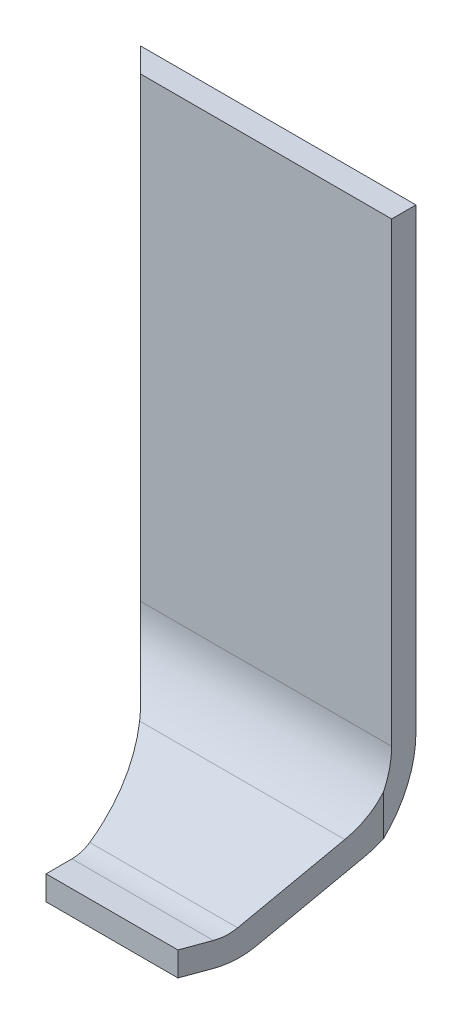
ISO-10303-21;
HEADER;
FILE_DESCRIPTION(('STEP AP214'),'2;1');
FILE_NAME('part.step','',(''),(''),'','','');
FILE_SCHEMA(('AUTOMOTIVE_DESIGN { 1 0 10303 214 1 1 1 1 }'));
ENDSEC;
DATA;
#1=APPLICATION_CONTEXT('core data for automotive mechanical design processes');
#2=APPLICATION_PROTOCOL_DEFINITION('international standard','automotive_design',2000,#1);
#3=PRODUCT_CONTEXT('',#1,'mechanical');
#4=PRODUCT('Part','Part','',(#3));
#5=PRODUCT_RELATED_PRODUCT_CATEGORY('part','',(#4));
#6=PRODUCT_DEFINITION_FORMATION('','',#4);
#7=PRODUCT_DEFINITION_CONTEXT('part definition',#1,'design');
#8=PRODUCT_DEFINITION('design','',#6,#7);
#9=PRODUCT_DEFINITION_SHAPE('','',#8);
#10=(LENGTH_UNIT() NAMED_UNIT(*) SI_UNIT(.MILLI.,.METRE.));
#11=(NAMED_UNIT(*) PLANE_ANGLE_UNIT() SI_UNIT($,.RADIAN.));
#12=(NAMED_UNIT(*) SI_UNIT($,.STERADIAN.) SOLID_ANGLE_UNIT());
#13=UNCERTAINTY_MEASURE_WITH_UNIT(LENGTH_MEASURE(1.E-05),#10,'distance_accuracy_value','');
#14=(GEOMETRIC_REPRESENTATION_CONTEXT(3) GLOBAL_UNCERTAINTY_ASSIGNED_CONTEXT((#13)) GLOBAL_UNIT_ASSIGNED_CONTEXT((#10,
#11,#12)) REPRESENTATION_CONTEXT('',''));
#15=CARTESIAN_POINT('',(0.,0.,0.));
#16=DIRECTION('',(0.,0.,1.));
#17=DIRECTION('',(1.,0.,0.));
#18=AXIS2_PLACEMENT_3D('',#15,#16,#17);
#19=CARTESIAN_POINT('',(100.,0.,0.));
#20=DIRECTION('',(0.,0.,-1.));
#21=DIRECTION('',(-1.,0.,0.));
#22=AXIS2_PLACEMENT_3D('',#19,#20,#21);
#23=PLANE('',#22);
#24=DIRECTION('',(-1.,0.,0.));
#25=VECTOR('',#24,1.);
#26=CARTESIAN_POINT('',(100.,15.,0.));
#27=LINE('',#26,#25);
#28=CARTESIAN_POINT('',(56.4558441227153,15.,0.));
#29=VERTEX_POINT('',#28);
#30=CARTESIAN_POINT('',(-25.,15.,0.));
#31=VERTEX_POINT('',#30);
#32=EDGE_CURVE('E160',#29,#31,#27,.T.);
#33=ORIENTED_EDGE('',*,*,#32,.T.);
#34=DIRECTION('',(0.,-1.,0.));
#35=VECTOR('',#34,1.);
#36=CARTESIAN_POINT('',(-25.,374.,0.));
#37=LINE('',#36,#35);
#38=CARTESIAN_POINT('',(-25.,0.,0.));
#39=VERTEX_POINT('',#38);
#40=EDGE_CURVE('E61',#31,#39,#37,.T.);
#41=ORIENTED_EDGE('',*,*,#40,.T.);
#42=DIRECTION('',(-1.,0.,0.));
#43=VECTOR('',#42,1.);
#44=CARTESIAN_POINT('',(100.,0.,0.));
#45=LINE('',#44,#43);
#46=CARTESIAN_POINT('',(56.4558441227153,0.,0.));
#47=VERTEX_POINT('',#46);
#48=EDGE_CURVE('E158',#47,#39,#45,.T.);
#49=ORIENTED_EDGE('',*,*,#48,.F.);
#50=DIRECTION('',(0.,-1.,0.));
#51=VECTOR('',#50,1.);
#52=CARTESIAN_POINT('',(56.4558441227153,374.,0.));
#53=LINE('',#52,#51);
#54=EDGE_CURVE('E162',#29,#47,#53,.T.);
#55=ORIENTED_EDGE('',*,*,#54,.F.);
#56=EDGE_LOOP('',(#33,#41,#49,#55));
#57=FACE_BOUND('',#56,.T.);
#58=ADVANCED_FACE('F39',(#57),#23,.F.);
#59=CARTESIAN_POINT('',(100.,0.,0.));
#60=DIRECTION('',(0.,1.,0.));
#61=DIRECTION('',(0.,0.,1.));
#62=AXIS2_PLACEMENT_3D('',#59,#60,#61);
#63=PLANE('',#62);
#64=ORIENTED_EDGE('',*,*,#48,.T.);
#65=DIRECTION('',(0.,0.,1.));
#66=VECTOR('',#65,1.);
#67=CARTESIAN_POINT('',(-25.,0.,-25.318759132868));
#68=LINE('',#67,#66);
#69=CARTESIAN_POINT('',(-25.,0.,-16.));
#70=VERTEX_POINT('',#69);
#71=EDGE_CURVE('E143',#70,#39,#68,.T.);
#72=ORIENTED_EDGE('',*,*,#71,.F.);
#73=DIRECTION('',(-1.,0.,0.));
#74=VECTOR('',#73,1.);
#75=CARTESIAN_POINT('',(100.,0.,-16.));
#76=LINE('',#75,#74);
#77=CARTESIAN_POINT('',(62.3053064883067,0.,-16.));
#78=VERTEX_POINT('',#77);
#79=EDGE_CURVE('E167',#78,#70,#76,.T.);
#80=ORIENTED_EDGE('',*,*,#79,.F.);
#81=DIRECTION('',(0.343364283388034,0.,-0.939202304561388));
#82=VECTOR('',#81,1.);
#83=CARTESIAN_POINT('',(56.4558441227153,0.,0.));
#84=LINE('',#83,#82);
#85=EDGE_CURVE('E152',#47,#78,#84,.T.);
#86=ORIENTED_EDGE('',*,*,#85,.F.);
#87=EDGE_LOOP('',(#64,#72,#80,#86));
#88=FACE_BOUND('',#87,.T.);
#89=ADVANCED_FACE('F165',(#88),#63,.F.);
#90=CARTESIAN_POINT('',(100.,35.,-16.));
#91=DIRECTION('',(-1.,0.,0.));
#92=DIRECTION('',(0.,0.,1.));
#93=AXIS2_PLACEMENT_3D('',#90,#91,#92);
#94=CYLINDRICAL_SURFACE('',#93,35.);
#95=CARTESIAN_POINT('',(-25.,35.,-16.));
#96=DIRECTION('',(1.,0.,0.));
#97=DIRECTION('',(0.,0.,-1.));
#98=AXIS2_PLACEMENT_3D('',#95,#96,#97);
#99=CIRCLE('',#98,35.);
#100=CARTESIAN_POINT('',(-25.,1.26336222704477,-25.318759132868));
#101=VERTEX_POINT('',#100);
#102=EDGE_CURVE('E147',#70,#101,#99,.T.);
#103=ORIENTED_EDGE('',*,*,#102,.T.);
#104=CARTESIAN_POINT('',(-25.,1.2633622270448,-25.318759132868));
#105=CARTESIAN_POINT('',(-24.9999957212439,1.38509776705038,-25.7594864278338));
#106=CARTESIAN_POINT('',(-25.0036428028565,1.51546117895549,-26.1977754243606));
#107=CARTESIAN_POINT('',(-25.0179583709849,1.79321230291684,-27.0687938159483));
#108=CARTESIAN_POINT('',(-25.0286266191503,1.94059943692166,-27.5015233992285));
#109=CARTESIAN_POINT('',(-25.0705479480293,2.405814057852,-28.7844682108337));
#110=CARTESIAN_POINT('',(-25.1117259504288,2.74838145249886,-29.6255353167193));
#111=CARTESIAN_POINT('',(-25.217908974446,3.49714926151641,-31.2771919950093));
#112=CARTESIAN_POINT('',(-25.2829127639663,3.90334638479637,-32.0877831410202));
#113=CARTESIAN_POINT('',(-25.3960728088775,4.55954066528769,-33.2796461083292));
#114=CARTESIAN_POINT('',(-25.4365686131965,4.78695324688894,-33.6742462848748));
#115=CARTESIAN_POINT('',(-25.5223099262804,5.2567473422439,-34.4538890248344));
#116=CARTESIAN_POINT('',(-25.5675552882865,5.49912839338441,-34.8389318831103));
#117=CARTESIAN_POINT('',(-25.614950308993,5.74881618733997,-35.2189553711427));
#118=B_SPLINE_CURVE_WITH_KNOTS('',3,(#104,#105,#106,#107,#108,#109,#110,#111,#112,#113,#114,
#115,#116,#117),.UNSPECIFIED.,.F.,.F.,(4,2,2,2,2,2,4),(0.,1.37148687911596,2.74292720219678,
5.46689395464629,8.19071986312818,9.56210788860727,10.9334535513714),.UNSPECIFIED.);
#119=CARTESIAN_POINT('',(-25.6149503089929,5.74881618733996,-35.2189553711427));
#120=VERTEX_POINT('',#119);
#121=EDGE_CURVE('E240',#101,#120,#118,.T.);
#122=ORIENTED_EDGE('',*,*,#121,.T.);
#123=DIRECTION('',(-1.,0.,0.));
#124=VECTOR('',#123,1.);
#125=CARTESIAN_POINT('',(100.,5.74881618733996,-35.2189553711427));
#126=LINE('',#125,#124);
#127=CARTESIAN_POINT('',(69.3315912476492,5.74881618733995,-35.2189553711427));
#128=VERTEX_POINT('',#127);
#129=EDGE_CURVE('E171',#128,#120,#126,.T.);
#130=ORIENTED_EDGE('',*,*,#129,.F.);
#131=CARTESIAN_POINT('',(62.3053064883067,35.,-16.));
#132=DIRECTION('',(-0.939202304561388,0.,-0.343364283388034));
#133=DIRECTION('',(-0.343364283388034,0.,0.939202304561388));
#134=AXIS2_PLACEMENT_3D('',#131,#132,#133);
#135=ELLIPSE('',#134,37.2656666513879,35.);
#136=EDGE_CURVE('E298',#128,#78,#135,.T.);
#137=ORIENTED_EDGE('',*,*,#136,.T.);
#138=ORIENTED_EDGE('',*,*,#79,.T.);
#139=EDGE_LOOP('',(#103,#122,#130,#137,#138));
#140=FACE_BOUND('',#139,.T.);
#141=ADVANCED_FACE('F235',(#140),#94,.T.);
#142=CARTESIAN_POINT('',(100.,5.74881618733996,-35.2189553711427));
#143=DIRECTION('',(0.,0.835748108933144,0.549113010604077));
#144=DIRECTION('',(0.,-0.549113010604078,0.835748108933144));
#145=AXIS2_PLACEMENT_3D('',#142,#143,#144);
#146=PLANE('',#145);
#147=CARTESIAN_POINT('',(-105.,-0.755926693753572,-25.318759132868));
#148=DIRECTION('',(0.,0.835748108933144,0.549113010604077));
#149=DIRECTION('',(0.,-0.549113010604078,0.835748108933144));
#150=AXIS2_PLACEMENT_3D('',#147,#148,#149);
#151=ELLIPSE('',#150,95.7226216187582,80.);
#152=CARTESIAN_POINT('',(-48.4314575050765,36.4113996128829,-81.8873016277921));
#153=VERTEX_POINT('',#152);
#154=EDGE_CURVE('E207',#120,#153,#151,.T.);
#155=ORIENTED_EDGE('',*,*,#154,.T.);
#156=DIRECTION('',(-0.641277253861583,0.421339491810941,-0.641277253861577));
#157=VECTOR('',#156,1.);
#158=CARTESIAN_POINT('',(40.0855961112867,-21.7471116437325,6.62975198857024));
#159=LINE('',#158,#157);
#160=CARTESIAN_POINT('',(-50.2365015665495,37.5973708023765,-83.6923456892651));
#161=VERTEX_POINT('',#160);
#162=EDGE_CURVE('E264',#153,#161,#159,.T.);
#163=ORIENTED_EDGE('',*,*,#162,.T.);
#164=DIRECTION('',(-1.,0.,0.));
#165=VECTOR('',#164,1.);
#166=CARTESIAN_POINT('',(100.,37.5973708023765,-83.6923456892651));
#167=LINE('',#166,#165);
#168=CARTESIAN_POINT('',(87.0530457725541,37.5973708023765,-83.6923456892651));
#169=VERTEX_POINT('',#168);
#170=EDGE_CURVE('E289',#169,#161,#167,.T.);
#171=ORIENTED_EDGE('',*,*,#170,.F.);
#172=DIRECTION('',(-0.292206958035671,-0.525147032869903,0.799271973450512));
#173=VECTOR('',#172,1.);
#174=CARTESIAN_POINT('',(71.9502104560889,10.4549331010939,-42.3816490883455));
#175=LINE('',#174,#173);
#176=EDGE_CURVE('E296',#169,#128,#175,.T.);
#177=ORIENTED_EDGE('',*,*,#176,.T.);
#178=ORIENTED_EDGE('',*,*,#129,.T.);
#179=EDGE_LOOP('',(#155,#163,#171,#177,#178));
#180=FACE_BOUND('',#179,.T.);
#181=ADVANCED_FACE('F231',(#180),#146,.F.);
#182=CARTESIAN_POINT('',(100.,91.9209978830308,-48.));
#183=DIRECTION('',(-1.,0.,0.));
#184=DIRECTION('',(0.,0.,1.));
#185=AXIS2_PLACEMENT_3D('',#182,#183,#184);
#186=CYLINDRICAL_SURFACE('',#185,65.);
#187=ORIENTED_EDGE('',*,*,#170,.T.);
#188=CARTESIAN_POINT('',(-14.5441558772841,91.9209978830308,-48.));
#189=DIRECTION('',(0.707106781186544,0.,-0.707106781186551));
#190=DIRECTION('',(-0.707106781186551,0.,-0.707106781186544));
#191=AXIS2_PLACEMENT_3D('',#188,#189,#190);
#192=ELLIPSE('',#191,91.9238815542516,65.);
#193=CARTESIAN_POINT('',(-79.5441558772848,91.9209978830308,-113.));
#194=VERTEX_POINT('',#193);
#195=EDGE_CURVE('E261',#161,#194,#192,.T.);
#196=ORIENTED_EDGE('',*,*,#195,.T.);
#197=DIRECTION('',(-1.,0.,0.));
#198=VECTOR('',#197,1.);
#199=CARTESIAN_POINT('',(100.,91.9209978830308,-113.));
#200=LINE('',#199,#198);
#201=CARTESIAN_POINT('',(90.4558441227153,91.9209978830308,-113.));
#202=VERTEX_POINT('',#201);
#203=EDGE_CURVE('E286',#202,#194,#200,.T.);
#204=ORIENTED_EDGE('',*,*,#203,.F.);
#205=CARTESIAN_POINT('',(90.4558441227153,91.9209978830308,-48.));
#206=DIRECTION('',(-1.,0.,0.));
#207=DIRECTION('',(0.,0.,1.));
#208=AXIS2_PLACEMENT_3D('',#205,#206,#207);
#209=CIRCLE('',#208,65.);
#210=CARTESIAN_POINT('',(90.4558441227153,45.0168402847965,-93.));
#211=VERTEX_POINT('',#210);
#212=EDGE_CURVE('E252',#202,#211,#209,.T.);
#213=ORIENTED_EDGE('',*,*,#212,.T.);
#214=CARTESIAN_POINT('',(74.0042312194895,91.9209978830308,-48.));
#215=DIRECTION('',(-0.939202304561388,0.,-0.343364283388034));
#216=DIRECTION('',(-0.343364283388034,0.,0.939202304561388));
#217=AXIS2_PLACEMENT_3D('',#214,#215,#216);
#218=ELLIPSE('',#217,69.2076666382919,65.);
#219=EDGE_CURVE('E315',#211,#169,#218,.T.);
#220=ORIENTED_EDGE('',*,*,#219,.T.);
#221=EDGE_LOOP('',(#187,#196,#204,#213,#220));
#222=FACE_BOUND('',#221,.T.);
#223=ADVANCED_FACE('F227',(#222),#186,.T.);
#224=CARTESIAN_POINT('',(100.,91.9209978830308,-113.));
#225=DIRECTION('',(0.,0.,1.));
#226=DIRECTION('',(0.,-1.,0.));
#227=AXIS2_PLACEMENT_3D('',#224,#225,#226);
#228=PLANE('',#227);
#229=ORIENTED_EDGE('',*,*,#203,.T.);
#230=DIRECTION('',(0.,1.,0.));
#231=VECTOR('',#230,1.);
#232=CARTESIAN_POINT('',(-79.5441558772848,91.9209978830308,-113.));
#233=LINE('',#232,#231);
#234=CARTESIAN_POINT('',(-79.5441558772848,374.,-113.));
#235=VERTEX_POINT('',#234);
#236=EDGE_CURVE('E258',#194,#235,#233,.T.);
#237=ORIENTED_EDGE('',*,*,#236,.T.);
#238=DIRECTION('',(-1.,0.,0.));
#239=VECTOR('',#238,1.);
#240=CARTESIAN_POINT('',(100.,374.,-113.));
#241=LINE('',#240,#239);
#242=CARTESIAN_POINT('',(90.4558441227153,374.,-113.));
#243=VERTEX_POINT('',#242);
#244=EDGE_CURVE('E283',#243,#235,#241,.T.);
#245=ORIENTED_EDGE('',*,*,#244,.F.);
#246=DIRECTION('',(0.,-1.,0.));
#247=VECTOR('',#246,1.);
#248=CARTESIAN_POINT('',(90.4558441227153,91.9209978830308,-113.));
#249=LINE('',#248,#247);
#250=EDGE_CURVE('E249',#243,#202,#249,.T.);
#251=ORIENTED_EDGE('',*,*,#250,.T.);
#252=EDGE_LOOP('',(#229,#237,#245,#251));
#253=FACE_BOUND('',#252,.T.);
#254=ADVANCED_FACE('F223',(#253),#228,.F.);
#255=CARTESIAN_POINT('',(100.,374.,-98.));
#256=DIRECTION('',(0.,-1.,0.));
#257=DIRECTION('',(0.,0.,-1.));
#258=AXIS2_PLACEMENT_3D('',#255,#256,#257);
#259=PLANE('',#258);
#260=ORIENTED_EDGE('',*,*,#244,.T.);
#261=DIRECTION('',(0.707106781186551,0.,0.707106781186544));
#262=VECTOR('',#261,1.);
#263=CARTESIAN_POINT('',(-84.5441558772848,374.,-118.));
#264=LINE('',#263,#262);
#265=CARTESIAN_POINT('',(-64.5441558772846,374.,-98.));
#266=VERTEX_POINT('',#265);
#267=EDGE_CURVE('E334',#235,#266,#264,.T.);
#268=ORIENTED_EDGE('',*,*,#267,.T.);
#269=DIRECTION('',(-1.,0.,0.));
#270=VECTOR('',#269,1.);
#271=CARTESIAN_POINT('',(100.,374.,-98.));
#272=LINE('',#271,#270);
#273=CARTESIAN_POINT('',(90.4558441227153,374.,-98.));
#274=VERTEX_POINT('',#273);
#275=EDGE_CURVE('E280',#274,#266,#272,.T.);
#276=ORIENTED_EDGE('',*,*,#275,.F.);
#277=DIRECTION('',(0.,0.,-1.));
#278=VECTOR('',#277,1.);
#279=CARTESIAN_POINT('',(90.4558441227153,374.,-93.));
#280=LINE('',#279,#278);
#281=EDGE_CURVE('E331',#274,#243,#280,.T.);
#282=ORIENTED_EDGE('',*,*,#281,.T.);
#283=EDGE_LOOP('',(#260,#268,#276,#282));
#284=FACE_BOUND('',#283,.T.);
#285=ADVANCED_FACE('F219',(#284),#259,.F.);
#286=CARTESIAN_POINT('',(100.,91.9209978830308,-98.));
#287=DIRECTION('',(0.,0.,-1.));
#288=DIRECTION('',(0.,1.,0.));
#289=AXIS2_PLACEMENT_3D('',#286,#287,#288);
#290=PLANE('',#289);
#291=ORIENTED_EDGE('',*,*,#275,.T.);
#292=DIRECTION('',(0.,-1.,0.));
#293=VECTOR('',#292,1.);
#294=CARTESIAN_POINT('',(-64.5441558772846,91.9209978830308,-98.));
#295=LINE('',#294,#293);
#296=CARTESIAN_POINT('',(-64.5441558772846,91.9209978830308,-98.));
#297=VERTEX_POINT('',#296);
#298=EDGE_CURVE('E255',#266,#297,#295,.T.);
#299=ORIENTED_EDGE('',*,*,#298,.T.);
#300=DIRECTION('',(-1.,0.,0.));
#301=VECTOR('',#300,1.);
#302=CARTESIAN_POINT('',(100.,91.9209978830308,-98.));
#303=LINE('',#302,#301);
#304=CARTESIAN_POINT('',(90.4558441227153,91.9209978830308,-98.));
#305=VERTEX_POINT('',#304);
#306=EDGE_CURVE('E277',#305,#297,#303,.T.);
#307=ORIENTED_EDGE('',*,*,#306,.F.);
#308=DIRECTION('',(0.,1.,0.));
#309=VECTOR('',#308,1.);
#310=CARTESIAN_POINT('',(90.4558441227153,91.9209978830308,-98.));
#311=LINE('',#310,#309);
#312=EDGE_CURVE('E246',#305,#274,#311,.T.);
#313=ORIENTED_EDGE('',*,*,#312,.T.);
#314=EDGE_LOOP('',(#291,#299,#307,#313));
#315=FACE_BOUND('',#314,.T.);
#316=ADVANCED_FACE('F215',(#315),#290,.F.);
#317=CARTESIAN_POINT('',(100.,91.9209978830308,-48.));
#318=DIRECTION('',(-1.,0.,0.));
#319=DIRECTION('',(0.,0.,1.));
#320=AXIS2_PLACEMENT_3D('',#317,#318,#319);
#321=CYLINDRICAL_SURFACE('',#320,50.);
#322=ORIENTED_EDGE('',*,*,#306,.T.);
#323=CARTESIAN_POINT('',(-14.5441558772841,91.9209978830308,-48.));
#324=DIRECTION('',(0.707106781186544,0.,-0.707106781186551));
#325=DIRECTION('',(-0.707106781186551,0.,-0.707106781186544));
#326=AXIS2_PLACEMENT_3D('',#323,#324,#325);
#327=ELLIPSE('',#326,70.7106781186551,50.);
#328=CARTESIAN_POINT('',(-48.4314575050765,55.1561942199206,-81.8873016277921));
#329=VERTEX_POINT('',#328);
#330=EDGE_CURVE('E11',#297,#329,#327,.F.);
#331=ORIENTED_EDGE('',*,*,#330,.T.);
#332=CARTESIAN_POINT('',(-48.4314575050765,55.1561942199206,-81.8873016277921));
#333=CARTESIAN_POINT('',(-47.9373338272909,54.7007679452531,-81.3931838819725));
#334=CARTESIAN_POINT('',(-47.4456599696088,54.2540423848876,-80.888555649533));
#335=CARTESIAN_POINT('',(-46.4689636004532,53.3791967311158,-79.8588412841599));
#336=CARTESIAN_POINT('',(-45.983933690948,52.9510545551127,-79.3337809214316));
#337=CARTESIAN_POINT('',(-45.0210547792116,52.1134556441432,-78.262548253052));
#338=CARTESIAN_POINT('',(-44.5432058978835,51.7039992235425,-77.7163755924967));
#339=CARTESIAN_POINT('',(-43.5952678979652,50.9041370683669,-76.6022327156402));
#340=CARTESIAN_POINT('',(-43.1251889959408,50.5137552713649,-76.0342366311746));
#341=CARTESIAN_POINT('',(-42.6598674928282,50.1335924363736,-75.4556505302039));
#342=B_SPLINE_CURVE_WITH_KNOTS('',3,(#332,#333,#334,#335,#336,#337,#338,#339,#340,#341),
.UNSPECIFIED.,.F.,.F.,(4,2,2,2,4),(0.,2.50222139706664,5.00138310727987,7.50058684743089,
10.0028503726069),.UNSPECIFIED.);
#343=CARTESIAN_POINT('',(-42.6598674928282,50.1335924363736,-75.4556505302039));
#344=VERTEX_POINT('',#343);
#345=EDGE_CURVE('E199',#329,#344,#342,.T.);
#346=ORIENTED_EDGE('',*,*,#345,.T.);
#347=DIRECTION('',(-1.,0.,0.));
#348=VECTOR('',#347,1.);
#349=CARTESIAN_POINT('',(100.,50.1335924363736,-75.4556505302039));
#350=LINE('',#349,#348);
#351=CARTESIAN_POINT('',(84.041780875693,50.1335924363736,-75.4556505302039));
#352=VERTEX_POINT('',#351);
#353=EDGE_CURVE('E274',#352,#344,#350,.T.);
#354=ORIENTED_EDGE('',*,*,#353,.F.);
#355=CARTESIAN_POINT('',(74.0042312194895,91.9209978830308,-48.));
#356=DIRECTION('',(-0.939202304561388,0.,-0.343364283388034));
#357=DIRECTION('',(-0.343364283388034,0.,0.939202304561388));
#358=AXIS2_PLACEMENT_3D('',#355,#356,#357);
#359=ELLIPSE('',#358,53.2366666448399,50.);
#360=CARTESIAN_POINT('',(90.4558441227153,70.1265031653274,-93.));
#361=VERTEX_POINT('',#360);
#362=EDGE_CURVE('E312',#352,#361,#359,.F.);
#363=ORIENTED_EDGE('',*,*,#362,.T.);
#364=CARTESIAN_POINT('',(90.4558441227153,91.9209978830308,-48.));
#365=DIRECTION('',(-1.,0.,0.));
#366=DIRECTION('',(0.,0.,1.));
#367=AXIS2_PLACEMENT_3D('',#364,#365,#366);
#368=CIRCLE('',#367,50.);
#369=EDGE_CURVE('E46',#361,#305,#368,.F.);
#370=ORIENTED_EDGE('',*,*,#369,.T.);
#371=EDGE_LOOP('',(#322,#331,#346,#354,#363,#370));
#372=FACE_BOUND('',#371,.T.);
#373=ADVANCED_FACE('F210',(#372),#321,.F.);
#374=CARTESIAN_POINT('',(100.,18.2850378213371,-26.9822602120815));
#375=DIRECTION('',(0.,-0.835748108933144,-0.549113010604078));
#376=DIRECTION('',(0.,0.549113010604078,-0.835748108933144));
#377=AXIS2_PLACEMENT_3D('',#374,#375,#376);
#378=PLANE('',#377);
#379=ORIENTED_EDGE('',*,*,#353,.T.);
#380=CARTESIAN_POINT('',(-105.,17.1920648597637,-25.318759132868));
#381=DIRECTION('',(0.,-0.835748108933144,-0.549113010604078));
#382=DIRECTION('',(0.,-0.549113010604078,0.835748108933144));
#383=AXIS2_PLACEMENT_3D('',#380,#381,#382);
#384=ELLIPSE('',#383,95.7226216187581,80.);
#385=CARTESIAN_POINT('',(-25.0172970939375,18.2850378213371,-26.9822602120816));
#386=VERTEX_POINT('',#385);
#387=EDGE_CURVE('E208',#344,#386,#384,.T.);
#388=ORIENTED_EDGE('',*,*,#387,.T.);
#389=DIRECTION('',(-1.,0.,0.));
#390=VECTOR('',#389,1.);
#391=CARTESIAN_POINT('',(100.,18.2850378213371,-26.9822602120815));
#392=LINE('',#391,#390);
#393=CARTESIAN_POINT('',(66.3203263507881,18.2850378213371,-26.9822602120815));
#394=VERTEX_POINT('',#393);
#395=EDGE_CURVE('E271',#394,#386,#392,.T.);
#396=ORIENTED_EDGE('',*,*,#395,.F.);
#397=DIRECTION('',(0.292206958035671,0.525147032869903,-0.799271973450512));
#398=VECTOR('',#397,1.);
#399=CARTESIAN_POINT('',(69.1960621303644,23.4532382027188,-34.8482433738639));
#400=LINE('',#399,#398);
#401=EDGE_CURVE('E309',#394,#352,#400,.T.);
#402=ORIENTED_EDGE('',*,*,#401,.T.);
#403=EDGE_LOOP('',(#379,#388,#396,#402));
#404=FACE_BOUND('',#403,.T.);
#405=ADVANCED_FACE('F214',(#404),#378,.F.);
#406=CARTESIAN_POINT('',(100.,35.,-16.));
#407=DIRECTION('',(-1.,0.,0.));
#408=DIRECTION('',(0.,0.,1.));
#409=AXIS2_PLACEMENT_3D('',#406,#407,#408);
#410=CYLINDRICAL_SURFACE('',#409,20.);
#411=ORIENTED_EDGE('',*,*,#395,.T.);
#412=CARTESIAN_POINT('',(-25.0172970939375,18.2850378213371,-26.9822602120816));
#413=CARTESIAN_POINT('',(-25.0144975877434,18.1966049453028,-26.8476664369778));
#414=CARTESIAN_POINT('',(-25.0120160236706,18.1097953461214,-26.7119993466183));
#415=CARTESIAN_POINT('',(-25.0077226685807,17.939524966377,-26.4386826464297));
#416=CARTESIAN_POINT('',(-25.0059104753999,17.8560622019673,-26.3010342787926));
#417=CARTESIAN_POINT('',(-25.0029863026344,17.6924811623653,-26.0237568807919));
#418=CARTESIAN_POINT('',(-25.0018743233645,17.612362888676,-25.8841278495385));
#419=CARTESIAN_POINT('',(-25.0003808406004,17.4554716405031,-25.6028887393027));
#420=CARTESIAN_POINT('',(-24.9999997773668,17.3787007094477,-25.4612775180564));
#421=CARTESIAN_POINT('',(-25.,17.3036521218758,-25.318759132868));
#422=B_SPLINE_CURVE_WITH_KNOTS('',3,(#412,#413,#414,#415,#416,#417,#418,#419,#420,#421),
.UNSPECIFIED.,.F.,.F.,(4,2,2,2,4),(0.,0.483199522836118,0.966108261129157,1.44901721642609,
1.93221695626941),.UNSPECIFIED.);
#423=CARTESIAN_POINT('',(-25.,17.3036521218758,-25.318759132868));
#424=VERTEX_POINT('',#423);
#425=EDGE_CURVE('E176',#386,#424,#422,.T.);
#426=ORIENTED_EDGE('',*,*,#425,.T.);
#427=CARTESIAN_POINT('',(-25.,35.,-16.));
#428=DIRECTION('',(1.,0.,0.));
#429=DIRECTION('',(0.,0.,-1.));
#430=AXIS2_PLACEMENT_3D('',#427,#428,#429);
#431=CIRCLE('',#430,20.);
#432=CARTESIAN_POINT('',(-25.,15.,-16.));
#433=VERTEX_POINT('',#432);
#434=EDGE_CURVE('E302',#424,#433,#431,.F.);
#435=ORIENTED_EDGE('',*,*,#434,.T.);
#436=DIRECTION('',(-1.,0.,0.));
#437=VECTOR('',#436,1.);
#438=CARTESIAN_POINT('',(100.,15.,-16.));
#439=LINE('',#438,#437);
#440=CARTESIAN_POINT('',(62.3053064883067,15.,-16.));
#441=VERTEX_POINT('',#440);
#442=EDGE_CURVE('E268',#441,#433,#439,.T.);
#443=ORIENTED_EDGE('',*,*,#442,.F.);
#444=CARTESIAN_POINT('',(62.3053064883067,35.,-16.));
#445=DIRECTION('',(-0.939202304561388,0.,-0.343364283388034));
#446=DIRECTION('',(-0.343364283388034,0.,0.939202304561388));
#447=AXIS2_PLACEMENT_3D('',#444,#445,#446);
#448=ELLIPSE('',#447,21.294666657936,20.);
#449=EDGE_CURVE('E53',#441,#394,#448,.F.);
#450=ORIENTED_EDGE('',*,*,#449,.T.);
#451=EDGE_LOOP('',(#411,#426,#435,#443,#450));
#452=FACE_BOUND('',#451,.T.);
#453=ADVANCED_FACE('F183',(#452),#410,.F.);
#454=CARTESIAN_POINT('',(100.,15.,0.));
#455=DIRECTION('',(0.,-1.,0.));
#456=DIRECTION('',(0.,0.,-1.));
#457=AXIS2_PLACEMENT_3D('',#454,#455,#456);
#458=PLANE('',#457);
#459=ORIENTED_EDGE('',*,*,#442,.T.);
#460=DIRECTION('',(0.,0.,1.));
#461=VECTOR('',#460,1.);
#462=CARTESIAN_POINT('',(-25.,15.,0.));
#463=LINE('',#462,#461);
#464=EDGE_CURVE('E169',#433,#31,#463,.T.);
#465=ORIENTED_EDGE('',*,*,#464,.T.);
#466=ORIENTED_EDGE('',*,*,#32,.F.);
#467=DIRECTION('',(0.343364283388034,0.,-0.939202304561388));
#468=VECTOR('',#467,1.);
#469=CARTESIAN_POINT('',(61.589657911001,15.,-14.0424906561932));
#470=LINE('',#469,#468);
#471=EDGE_CURVE('E166',#29,#441,#470,.T.);
#472=ORIENTED_EDGE('',*,*,#471,.T.);
#473=EDGE_LOOP('',(#459,#465,#466,#472));
#474=FACE_BOUND('',#473,.T.);
#475=ADVANCED_FACE('F327',(#474),#458,.F.);
#476=CARTESIAN_POINT('',(56.4558441227153,374.,0.));
#477=DIRECTION('',(-0.939202304561388,0.,-0.343364283388034));
#478=DIRECTION('',(-0.343364283388034,0.,0.939202304561388));
#479=AXIS2_PLACEMENT_3D('',#476,#477,#478);
#480=PLANE('',#479);
#481=ORIENTED_EDGE('',*,*,#176,.F.);
#482=ORIENTED_EDGE('',*,*,#219,.F.);
#483=DIRECTION('',(0.,-1.,0.));
#484=VECTOR('',#483,1.);
#485=CARTESIAN_POINT('',(90.4558441227153,374.,-93.));
#486=LINE('',#485,#484);
#487=EDGE_CURVE('E329',#361,#211,#486,.T.);
#488=ORIENTED_EDGE('',*,*,#487,.F.);
#489=ORIENTED_EDGE('',*,*,#362,.F.);
#490=ORIENTED_EDGE('',*,*,#401,.F.);
#491=ORIENTED_EDGE('',*,*,#449,.F.);
#492=ORIENTED_EDGE('',*,*,#471,.F.);
#493=ORIENTED_EDGE('',*,*,#54,.T.);
#494=ORIENTED_EDGE('',*,*,#85,.T.);
#495=ORIENTED_EDGE('',*,*,#136,.F.);
#496=EDGE_LOOP('',(#481,#482,#488,#489,#490,#491,#492,#493,#494,#495));
#497=FACE_BOUND('',#496,.T.);
#498=ADVANCED_FACE('F328',(#497),#480,.F.);
#499=CARTESIAN_POINT('',(90.4558441227153,374.,-93.));
#500=DIRECTION('',(-1.,0.,0.));
#501=DIRECTION('',(0.,0.,1.));
#502=AXIS2_PLACEMENT_3D('',#499,#500,#501);
#503=PLANE('',#502);
#504=ORIENTED_EDGE('',*,*,#250,.F.);
#505=ORIENTED_EDGE('',*,*,#281,.F.);
#506=ORIENTED_EDGE('',*,*,#312,.F.);
#507=ORIENTED_EDGE('',*,*,#369,.F.);
#508=ORIENTED_EDGE('',*,*,#487,.T.);
#509=ORIENTED_EDGE('',*,*,#212,.F.);
#510=EDGE_LOOP('',(#504,#505,#506,#507,#508,#509));
#511=FACE_BOUND('',#510,.T.);
#512=ADVANCED_FACE('F345',(#511),#503,.F.);
#513=CARTESIAN_POINT('',(-84.5441558772848,374.,-118.));
#514=DIRECTION('',(0.707106781186544,0.,-0.707106781186551));
#515=DIRECTION('',(-0.707106781186551,0.,-0.707106781186544));
#516=AXIS2_PLACEMENT_3D('',#513,#514,#515);
#517=PLANE('',#516);
#518=DIRECTION('',(0.,-1.,0.));
#519=VECTOR('',#518,1.);
#520=CARTESIAN_POINT('',(-48.4314575050765,374.,-81.8873016277921));
#521=LINE('',#520,#519);
#522=EDGE_CURVE('E303',#329,#153,#521,.T.);
#523=ORIENTED_EDGE('',*,*,#522,.F.);
#524=ORIENTED_EDGE('',*,*,#330,.F.);
#525=ORIENTED_EDGE('',*,*,#298,.F.);
#526=ORIENTED_EDGE('',*,*,#267,.F.);
#527=ORIENTED_EDGE('',*,*,#236,.F.);
#528=ORIENTED_EDGE('',*,*,#195,.F.);
#529=ORIENTED_EDGE('',*,*,#162,.F.);
#530=EDGE_LOOP('',(#523,#524,#525,#526,#527,#528,#529));
#531=FACE_BOUND('',#530,.T.);
#532=ADVANCED_FACE('F192',(#531),#517,.F.);
#533=CARTESIAN_POINT('',(-105.,374.,-25.318759132868));
#534=DIRECTION('',(0.,-1.,0.));
#535=DIRECTION('',(0.,0.,-1.));
#536=AXIS2_PLACEMENT_3D('',#533,#534,#535);
#537=CYLINDRICAL_SURFACE('',#536,80.);
#538=DIRECTION('',(0.,-1.,0.));
#539=VECTOR('',#538,1.);
#540=CARTESIAN_POINT('',(-25.,374.,-25.318759132868));
#541=LINE('',#540,#539);
#542=EDGE_CURVE('E161',#424,#101,#541,.T.);
#543=ORIENTED_EDGE('',*,*,#542,.F.);
#544=ORIENTED_EDGE('',*,*,#425,.F.);
#545=ORIENTED_EDGE('',*,*,#387,.F.);
#546=ORIENTED_EDGE('',*,*,#345,.F.);
#547=ORIENTED_EDGE('',*,*,#522,.T.);
#548=ORIENTED_EDGE('',*,*,#154,.F.);
#549=ORIENTED_EDGE('',*,*,#121,.F.);
#550=EDGE_LOOP('',(#543,#544,#545,#546,#547,#548,#549));
#551=FACE_BOUND('',#550,.T.);
#552=ADVANCED_FACE('F187',(#551),#537,.F.);
#553=CARTESIAN_POINT('',(-25.,374.,-25.318759132868));
#554=DIRECTION('',(1.,0.,0.));
#555=DIRECTION('',(0.,0.,-1.));
#556=AXIS2_PLACEMENT_3D('',#553,#554,#555);
#557=PLANE('',#556);
#558=ORIENTED_EDGE('',*,*,#71,.T.);
#559=ORIENTED_EDGE('',*,*,#40,.F.);
#560=ORIENTED_EDGE('',*,*,#464,.F.);
#561=ORIENTED_EDGE('',*,*,#434,.F.);
#562=ORIENTED_EDGE('',*,*,#542,.T.);
#563=ORIENTED_EDGE('',*,*,#102,.F.);
#564=EDGE_LOOP('',(#558,#559,#560,#561,#562,#563));
#565=FACE_BOUND('',#564,.T.);
#566=ADVANCED_FACE('F144',(#565),#557,.F.);
#567=CLOSED_SHELL('',(#58,#89,#141,#181,#223,#254,#285,#316,#373,#405,#453,#475,#498,#512,#532,
#552,#566));
#568=MANIFOLD_SOLID_BREP('B2',#567);
#569=ADVANCED_BREP_SHAPE_REPRESENTATION('',(#18,#568),#14);
#570=SHAPE_DEFINITION_REPRESENTATION(#9,#569);
ENDSEC;
END-ISO-10303-21;
